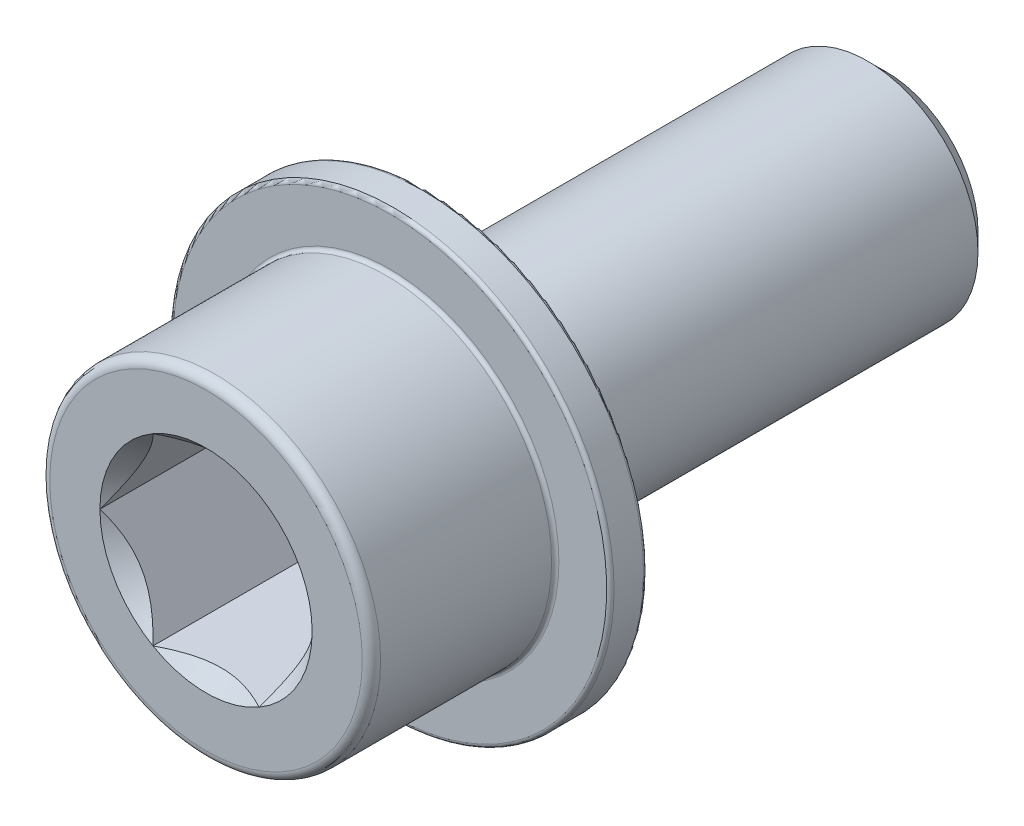
ISO-10303-21;
HEADER;
FILE_DESCRIPTION(('STEP AP214'),'2;1');
FILE_NAME('part.step','',(''),(''),'','','');
FILE_SCHEMA(('AUTOMOTIVE_DESIGN { 1 0 10303 214 1 1 1 1 }'));
ENDSEC;
DATA;
#1=APPLICATION_CONTEXT('core data for automotive mechanical design processes');
#2=APPLICATION_PROTOCOL_DEFINITION('international standard','automotive_design',2000,#1);
#3=PRODUCT_CONTEXT('',#1,'mechanical');
#4=PRODUCT('Part','Part','',(#3));
#5=PRODUCT_RELATED_PRODUCT_CATEGORY('part','',(#4));
#6=PRODUCT_DEFINITION_FORMATION('','',#4);
#7=PRODUCT_DEFINITION_CONTEXT('part definition',#1,'design');
#8=PRODUCT_DEFINITION('design','',#6,#7);
#9=PRODUCT_DEFINITION_SHAPE('','',#8);
#10=(LENGTH_UNIT() NAMED_UNIT(*) SI_UNIT(.MILLI.,.METRE.));
#11=(NAMED_UNIT(*) PLANE_ANGLE_UNIT() SI_UNIT($,.RADIAN.));
#12=(NAMED_UNIT(*) SI_UNIT($,.STERADIAN.) SOLID_ANGLE_UNIT());
#13=UNCERTAINTY_MEASURE_WITH_UNIT(LENGTH_MEASURE(1.E-05),#10,'distance_accuracy_value','');
#14=(GEOMETRIC_REPRESENTATION_CONTEXT(3) GLOBAL_UNCERTAINTY_ASSIGNED_CONTEXT((#13)) GLOBAL_UNIT_ASSIGNED_CONTEXT((#10,
#11,#12)) REPRESENTATION_CONTEXT('',''));
#15=CARTESIAN_POINT('',(0.,0.,0.));
#16=DIRECTION('',(0.,0.,1.));
#17=DIRECTION('',(1.,0.,0.));
#18=AXIS2_PLACEMENT_3D('',#15,#16,#17);
#19=CARTESIAN_POINT('',(0.,0.,37.));
#20=DIRECTION('',(0.,0.,-1.));
#21=DIRECTION('',(-1.,0.,0.));
#22=AXIS2_PLACEMENT_3D('',#19,#20,#21);
#23=CYLINDRICAL_SURFACE('',#22,9.);
#24=CARTESIAN_POINT('',(0.,0.,27.2));
#25=DIRECTION('',(0.,0.,-1.));
#26=DIRECTION('',(-1.,0.,0.));
#27=AXIS2_PLACEMENT_3D('',#24,#25,#26);
#28=CIRCLE('',#27,9.);
#29=CARTESIAN_POINT('',(-9.,0.,27.2));
#30=VERTEX_POINT('',#29);
#31=EDGE_CURVE('E11',#30,#30,#28,.F.);
#32=ORIENTED_EDGE('',*,*,#31,.T.);
#33=EDGE_LOOP('',(#32));
#34=FACE_BOUND('',#33,.T.);
#35=CARTESIAN_POINT('',(0.,0.,36.5));
#36=DIRECTION('',(0.,0.,1.));
#37=DIRECTION('',(1.,0.,0.));
#38=AXIS2_PLACEMENT_3D('',#35,#36,#37);
#39=CIRCLE('',#38,9.);
#40=CARTESIAN_POINT('',(9.,0.,36.5));
#41=VERTEX_POINT('',#40);
#42=EDGE_CURVE('E275',#41,#41,#39,.F.);
#43=ORIENTED_EDGE('',*,*,#42,.T.);
#44=EDGE_LOOP('',(#43));
#45=FACE_BOUND('',#44,.T.);
#46=ADVANCED_FACE('F41',(#34,#45),#23,.T.);
#47=CARTESIAN_POINT('',(0.,0.,37.));
#48=DIRECTION('',(0.,0.,1.));
#49=DIRECTION('',(1.,0.,0.));
#50=AXIS2_PLACEMENT_3D('',#47,#48,#49);
#51=PLANE('',#50);
#52=CARTESIAN_POINT('',(0.,0.,37.));
#53=DIRECTION('',(0.,0.,1.));
#54=DIRECTION('',(1.,0.,0.));
#55=AXIS2_PLACEMENT_3D('',#52,#53,#54);
#56=CIRCLE('',#55,8.5);
#57=CARTESIAN_POINT('',(8.5,0.,37.));
#58=VERTEX_POINT('',#57);
#59=EDGE_CURVE('E117',#58,#58,#56,.T.);
#60=ORIENTED_EDGE('',*,*,#59,.T.);
#61=EDGE_LOOP('',(#60));
#62=FACE_BOUND('',#61,.T.);
#63=CARTESIAN_POINT('',(0.,0.,37.));
#64=DIRECTION('',(0.,0.,1.));
#65=DIRECTION('',(1.,0.,0.));
#66=AXIS2_PLACEMENT_3D('',#63,#64,#65);
#67=CIRCLE('',#66,5.77350269189626);
#68=CARTESIAN_POINT('',(5.77350269189626,0.,37.));
#69=VERTEX_POINT('',#68);
#70=CARTESIAN_POINT('',(2.88675134594813,5.,37.));
#71=VERTEX_POINT('',#70);
#72=EDGE_CURVE('E96',#69,#71,#67,.T.);
#73=ORIENTED_EDGE('',*,*,#72,.F.);
#74=CARTESIAN_POINT('',(2.88675134594813,-5.,37.));
#75=VERTEX_POINT('',#74);
#76=EDGE_CURVE('E56',#75,#69,#67,.T.);
#77=ORIENTED_EDGE('',*,*,#76,.F.);
#78=CARTESIAN_POINT('',(-2.88675134594813,-5.,37.));
#79=VERTEX_POINT('',#78);
#80=EDGE_CURVE('E360',#79,#75,#67,.T.);
#81=ORIENTED_EDGE('',*,*,#80,.F.);
#82=CARTESIAN_POINT('',(-5.77350269189626,0.,37.));
#83=VERTEX_POINT('',#82);
#84=EDGE_CURVE('E63',#83,#79,#67,.T.);
#85=ORIENTED_EDGE('',*,*,#84,.F.);
#86=CARTESIAN_POINT('',(-2.88675134594813,5.,37.));
#87=VERTEX_POINT('',#86);
#88=EDGE_CURVE('E141',#87,#83,#67,.T.);
#89=ORIENTED_EDGE('',*,*,#88,.F.);
#90=EDGE_CURVE('E106',#71,#87,#67,.T.);
#91=ORIENTED_EDGE('',*,*,#90,.F.);
#92=EDGE_LOOP('',(#73,#77,#81,#85,#89,#91));
#93=FACE_BOUND('',#92,.T.);
#94=ADVANCED_FACE('F140',(#62,#93),#51,.T.);
#95=CARTESIAN_POINT('',(0.,0.,37.));
#96=DIRECTION('',(0.,0.,1.));
#97=DIRECTION('',(1.,0.,0.));
#98=AXIS2_PLACEMENT_3D('',#95,#96,#97);
#99=CONICAL_SURFACE('',#98,5.77350269189626,0.750491578357562);
#100=ORIENTED_EDGE('',*,*,#90,.T.);
#101=CARTESIAN_POINT('',(-5.80758708365003,5.,39.0266924983365));
#102=CARTESIAN_POINT('',(-5.66865629007263,5.,38.9138127130235));
#103=CARTESIAN_POINT('',(-5.52889793648,5.,38.8019351056511));
#104=CARTESIAN_POINT('',(-5.24739132077965,5.,38.580638613981));
#105=CARTESIAN_POINT('',(-5.1056425509307,5.,38.4712203762683));
#106=CARTESIAN_POINT('',(-4.81871487435336,5.,38.254466766855));
#107=CARTESIAN_POINT('',(-4.67351732727593,5.,38.1471559887066));
#108=CARTESIAN_POINT('',(-4.38046871079382,5.,37.9362345434395));
#109=CARTESIAN_POINT('',(-4.23261785089912,5.,37.8326235860917));
#110=CARTESIAN_POINT('',(-3.92683315677779,5.,37.6252088953714));
#111=CARTESIAN_POINT('',(-3.76875109674688,5.,37.5216226384209));
#112=CARTESIAN_POINT('',(-3.44860006517848,5.,37.3206998859556));
#113=CARTESIAN_POINT('',(-3.2865303934545,5.,37.2233644990234));
#114=CARTESIAN_POINT('',(-2.95838317622288,5.,37.0369808971182));
#115=CARTESIAN_POINT('',(-2.79232094070495,5.,36.9479059154129));
#116=CARTESIAN_POINT('',(-2.45517018440643,5.,36.7799114874638));
#117=CARTESIAN_POINT('',(-2.28408423421819,5.,36.7009869548332));
#118=CARTESIAN_POINT('',(-1.98420138431349,5.,36.5759442429651));
#119=CARTESIAN_POINT('',(-1.85668369197688,5.,36.5267669252763));
#120=CARTESIAN_POINT('',(-1.59878046410578,5.,36.4364409854512));
#121=CARTESIAN_POINT('',(-1.46839441463696,5.,36.3952938153605));
#122=CARTESIAN_POINT('',(-1.20618189730262,5.,36.322673503087));
#123=CARTESIAN_POINT('',(-1.0743786710018,5.,36.2911172981687));
#124=CARTESIAN_POINT('',(-0.808715932019676,5.,36.2383996188333));
#125=CARTESIAN_POINT('',(-0.674856892852049,5.,36.2172357867084));
#126=CARTESIAN_POINT('',(-0.401899799658879,5.,36.1857896131402));
#127=CARTESIAN_POINT('',(-0.262762574295458,5.,36.175841515954));
#128=CARTESIAN_POINT('',(0.0158398234206421,5.,36.1684669793754));
#129=CARTESIAN_POINT('',(0.15530497868332,5.,36.1710399013017));
#130=CARTESIAN_POINT('',(0.433665504023498,5.,36.188583322808));
#131=CARTESIAN_POINT('',(0.572559623573486,5.,36.2035734299528));
#132=CARTESIAN_POINT('',(0.848582612400783,5.,36.245215303668));
#133=CARTESIAN_POINT('',(0.985711136904931,5.,36.2718693133705));
#134=CARTESIAN_POINT('',(1.31134176502766,5.,36.3483053015187));
#135=CARTESIAN_POINT('',(1.49867542442878,5.,36.4030664771283));
#136=CARTESIAN_POINT('',(1.86761079985639,5.,36.5292693755651));
#137=CARTESIAN_POINT('',(2.04920912710151,5.,36.6007207581378));
#138=CARTESIAN_POINT('',(2.4088509799602,5.,36.7576881875208));
#139=CARTESIAN_POINT('',(2.58682221540366,5.,36.8433680887937));
#140=CARTESIAN_POINT('',(2.84964460165159,5.,36.9796538633223));
#141=CARTESIAN_POINT('',(2.9365527090353,5.,37.0263706463591));
#142=CARTESIAN_POINT('',(3.1090948045498,5.,37.1220981743121));
#143=CARTESIAN_POINT('',(3.19472883043855,5.,37.1711088510684));
#144=CARTESIAN_POINT('',(3.44856639783359,5.,37.3204058779647));
#145=CARTESIAN_POINT('',(3.61502982140971,5.,37.4236543117435));
#146=CARTESIAN_POINT('',(3.94395944593554,5.,37.6363575000928));
#147=CARTESIAN_POINT('',(4.10642475243023,5.,37.7458136256645));
#148=CARTESIAN_POINT('',(4.42805284665852,5.,37.9697135514027));
#149=CARTESIAN_POINT('',(4.58721302784413,5.,38.0841610827746));
#150=CARTESIAN_POINT('',(4.90263186914906,5.,38.3169973733478));
#151=CARTESIAN_POINT('',(5.05889030478379,5.,38.4353864355111));
#152=CARTESIAN_POINT('',(5.36952826406589,5.,38.6758169768031));
#153=CARTESIAN_POINT('',(5.52389824343529,5.,38.7978707578687));
#154=CARTESIAN_POINT('',(5.83051209253211,5.,39.0446237625617));
#155=CARTESIAN_POINT('',(5.98275588901246,5.,39.1693230769568));
#156=CARTESIAN_POINT('',(6.4367961421282,5.,39.5467110731217));
#157=CARTESIAN_POINT('',(6.73587657171413,5.,39.802670302999));
#158=CARTESIAN_POINT('',(7.16593516235032,5.,40.1785473745907));
#159=CARTESIAN_POINT('',(7.29907335598806,5.,40.2960191652605));
#160=CARTESIAN_POINT('',(7.56436261704639,5.,40.532055910625));
#161=CARTESIAN_POINT('',(7.6965137515873,5.,40.6506207897416));
#162=CARTESIAN_POINT('',(8.0917131015929,5.,41.0077812186704));
#163=CARTESIAN_POINT('',(8.35346780136019,5.,41.2478079212028));
#164=CARTESIAN_POINT('',(8.87188598984394,5.,41.7286102779452));
#165=CARTESIAN_POINT('',(9.1285741194123,5.,41.9693594407662));
#166=CARTESIAN_POINT('',(9.63970731590792,5.,42.4531282757413));
#167=CARTESIAN_POINT('',(9.89415281567278,5.,42.6961474902501));
#168=CARTESIAN_POINT('',(10.1477473123788,5.,42.940042639505));
#169=B_SPLINE_CURVE_WITH_KNOTS('',3,(#101,#102,#103,#104,#105,#106,#107,#108,#109,#110,#111,
#112,#113,#114,#115,#116,#117,#118,#119,#120,#121,#122,#123,#124,#125,#126,#127,#128,#129,#130,
#131,#132,#133,#134,#135,#136,#137,#138,#139,#140,#141,#142,#143,#144,#145,#146,#147,#148,#149,
#150,#151,#152,#153,#154,#155,#156,#157,#158,#159,#160,#161,#162,#163,#164,#165,#166,#167,#168),
.UNSPECIFIED.,.F.,.F.,(4,2,2,2,2,2,2,2,2,2,2,2,2,2,2,2,2,2,2,2,2,2,2,2,2,2,2,2,2,2,2,2,2,4),(0.,
0.537032521937178,1.07420461985825,1.61580322328329,2.1573592477286,2.72423532494798,
3.29121166074129,3.85628141753499,4.42106690554731,4.83086054028644,5.24072820714058,
5.64693782157675,6.05305523699244,6.47097964283559,6.8888827311043,7.30744697700931,
7.72609175409067,8.31058154073312,8.89541045280198,9.48751213288203,9.78349127781271,
10.0794616337318,10.6669174856502,11.2545035893655,11.8425367209901,12.4306151560463,
13.0209566103805,13.611318352079,14.7921366637501,15.3247964486711,15.8574196766327,
16.922823639663,17.9785742840354,19.0341164939846),.UNSPECIFIED.);
#170=EDGE_CURVE('E111',#71,#87,#169,.F.);
#171=ORIENTED_EDGE('',*,*,#170,.F.);
#172=EDGE_LOOP('',(#100,#171));
#173=FACE_BOUND('',#172,.T.);
#174=ADVANCED_FACE('F112',(#173),#99,.F.);
#175=ORIENTED_EDGE('',*,*,#88,.T.);
#176=CARTESIAN_POINT('',(-2.88663587589429,5.0002,37.0001238301874));
#177=CARTESIAN_POINT('',(-2.93339586390976,4.91920932499589,36.9499840138978));
#178=CARTESIAN_POINT('',(-2.98053379033613,4.83756404146197,36.9012512877692));
#179=CARTESIAN_POINT('',(-3.07564128643495,4.67283302603816,36.8070245965211));
#180=CARTESIAN_POINT('',(-3.12361127703016,4.58974656508865,36.7615323338394));
#181=CARTESIAN_POINT('',(-3.26935709555591,4.33730740241135,36.6301366115751));
#182=CARTESIAN_POINT('',(-3.36844052634802,4.16568986609118,36.5498923825744));
#183=CARTESIAN_POINT('',(-3.56866454479605,3.81889169324358,36.410108426193));
#184=CARTESIAN_POINT('',(-3.66975381389791,3.64379994305916,36.350282912226));
#185=CARTESIAN_POINT('',(-3.82334924134509,3.37776485891039,36.2785251413902));
#186=CARTESIAN_POINT('',(-3.87482121177902,3.28861279095313,36.2576148137686));
#187=CARTESIAN_POINT('',(-3.97831234653932,3.10936088741533,36.2222440250122));
#188=CARTESIAN_POINT('',(-4.03033142099721,3.01926120749156,36.2077825210077));
#189=CARTESIAN_POINT('',(-4.15393426093205,2.80517480876461,36.1816631188413));
#190=CARTESIAN_POINT('',(-4.22568233877823,2.68090349258962,36.1729888137491));
#191=CARTESIAN_POINT('',(-4.36928865720894,2.43217005277971,36.1689650395851));
#192=CARTESIAN_POINT('',(-4.44114692294564,2.30770788557996,36.1736192891434));
#193=CARTESIAN_POINT('',(-4.58441508762602,2.0595601452464,36.1960039502723));
#194=CARTESIAN_POINT('',(-4.65582448994055,1.9358754322995,36.213746910055));
#195=CARTESIAN_POINT('',(-4.79760141304727,1.69031059813788,36.2613846291909));
#196=CARTESIAN_POINT('',(-4.86796900839078,1.56843034779648,36.2912785146294));
#197=CARTESIAN_POINT('',(-5.01066397081816,1.32127542288813,36.3635432129595));
#198=CARTESIAN_POINT('',(-5.08292353946059,1.19611817866643,36.4064435225763));
#199=CARTESIAN_POINT('',(-5.22576763086089,0.948704954800094,36.5023651109165));
#200=CARTESIAN_POINT('',(-5.29635120779529,0.826450613369762,36.5553919586377));
#201=CARTESIAN_POINT('',(-5.43573312300757,0.585034054565836,36.6698219593191));
#202=CARTESIAN_POINT('',(-5.50453243256156,0.46587015489267,36.7312204361734));
#203=CARTESIAN_POINT('',(-5.64035275855527,0.23062244957099,36.860874116103));
#204=CARTESIAN_POINT('',(-5.7073767182989,0.114533545970578,36.9291169384668));
#205=CARTESIAN_POINT('',(-5.77361816195009,-0.000200000000002794,37.0001238301874));
#206=B_SPLINE_CURVE_WITH_KNOTS('',3,(#176,#177,#178,#179,#180,#181,#182,#183,#184,#185,#186,
#187,#188,#189,#190,#191,#192,#193,#194,#195,#196,#197,#198,#199,#200,#201,#202,#203,#204,#205),
.UNSPECIFIED.,.F.,.F.,(4,2,2,2,2,2,2,2,2,2,2,2,2,2,4),(0.,0.318321466427512,0.636808953996699,
1.27738825230496,1.90859395776303,2.22355579998591,2.53846668975006,2.96911088131721,
3.39987523313684,3.83105309849362,4.26219995831788,4.71401852227362,5.1660862790372,
5.61790255280598,6.06891579392637),.UNSPECIFIED.);
#207=EDGE_CURVE('E105',#87,#83,#206,.T.);
#208=ORIENTED_EDGE('',*,*,#207,.F.);
#209=EDGE_LOOP('',(#175,#208));
#210=FACE_BOUND('',#209,.T.);
#211=ADVANCED_FACE('F371',(#210),#99,.F.);
#212=ORIENTED_EDGE('',*,*,#84,.T.);
#213=CARTESIAN_POINT('',(-5.77361816195009,0.000199999999998372,37.0001238301874));
#214=CARTESIAN_POINT('',(-5.72685817393462,-0.0807906750041104,36.9499840138978));
#215=CARTESIAN_POINT('',(-5.67972024750825,-0.162435958538028,36.9012512877692));
#216=CARTESIAN_POINT('',(-5.58461275140944,-0.327166973961837,36.8070245965211));
#217=CARTESIAN_POINT('',(-5.53664276081422,-0.410253434911349,36.7615323338394));
#218=CARTESIAN_POINT('',(-5.39089694228848,-0.662692597588651,36.6301366115751));
#219=CARTESIAN_POINT('',(-5.29181351149637,-0.834310133908815,36.5498923825744));
#220=CARTESIAN_POINT('',(-5.09158949304834,-1.18110830675642,36.410108426193));
#221=CARTESIAN_POINT('',(-4.99050022394648,-1.35620005694084,36.350282912226));
#222=CARTESIAN_POINT('',(-4.8369047964993,-1.62223514108961,36.2785251413902));
#223=CARTESIAN_POINT('',(-4.78543282606537,-1.71138720904686,36.2576148137686));
#224=CARTESIAN_POINT('',(-4.68194169130506,-1.89063911258467,36.2222440250123));
#225=CARTESIAN_POINT('',(-4.62992261684718,-1.98073879250843,36.2077825210077));
#226=CARTESIAN_POINT('',(-4.50631977691234,-2.19482519123538,36.1816631188413));
#227=CARTESIAN_POINT('',(-4.43457169906615,-2.31909650741038,36.1729888137491));
#228=CARTESIAN_POINT('',(-4.29096538063544,-2.56782994722028,36.1689650395851));
#229=CARTESIAN_POINT('',(-4.21910711489874,-2.69229211442003,36.1736192891434));
#230=CARTESIAN_POINT('',(-4.07583895021836,-2.9404398547536,36.1960039502723));
#231=CARTESIAN_POINT('',(-4.00442954790383,-3.06412456770049,36.213746910055));
#232=CARTESIAN_POINT('',(-3.86265262479711,-3.30968940186212,36.2613846291909));
#233=CARTESIAN_POINT('',(-3.7922850294536,-3.43156965220352,36.2912785146294));
#234=CARTESIAN_POINT('',(-3.64959006702623,-3.67872457711187,36.3635432129595));
#235=CARTESIAN_POINT('',(-3.57733049838379,-3.80388182133357,36.4064435225763));
#236=CARTESIAN_POINT('',(-3.43448640698349,-4.0512950451999,36.5023651109165));
#237=CARTESIAN_POINT('',(-3.36390283004909,-4.17354938663023,36.5553919586377));
#238=CARTESIAN_POINT('',(-3.22452091483681,-4.41496594543416,36.6698219593191));
#239=CARTESIAN_POINT('',(-3.15572160528282,-4.53412984510733,36.7312204361734));
#240=CARTESIAN_POINT('',(-3.01990127928911,-4.76937755042901,36.860874116103));
#241=CARTESIAN_POINT('',(-2.95287731954548,-4.88546645402942,36.9291169384668));
#242=CARTESIAN_POINT('',(-2.88663587589429,-5.0002,37.0001238301874));
#243=B_SPLINE_CURVE_WITH_KNOTS('',3,(#213,#214,#215,#216,#217,#218,#219,#220,#221,#222,#223,
#224,#225,#226,#227,#228,#229,#230,#231,#232,#233,#234,#235,#236,#237,#238,#239,#240,#241,#242),
.UNSPECIFIED.,.F.,.F.,(4,2,2,2,2,2,2,2,2,2,2,2,2,2,4),(0.,0.318321466427509,0.636808953996697,
1.27738825230495,1.90859395776302,2.2235557999859,2.53846668975005,2.9691108813172,
3.39987523313683,3.83105309849361,4.26219995831788,4.71401852227361,5.1660862790372,
5.61790255280598,6.06891579392637),.UNSPECIFIED.);
#244=EDGE_CURVE('E154',#83,#79,#243,.T.);
#245=ORIENTED_EDGE('',*,*,#244,.F.);
#246=EDGE_LOOP('',(#212,#245));
#247=FACE_BOUND('',#246,.T.);
#248=ADVANCED_FACE('F373',(#247),#99,.F.);
#249=ORIENTED_EDGE('',*,*,#80,.T.);
#250=CARTESIAN_POINT('',(-5.80758708365002,-5.,39.0266924983365));
#251=CARTESIAN_POINT('',(-5.66865629007262,-5.,38.9138127130235));
#252=CARTESIAN_POINT('',(-5.52889793648,-5.,38.8019351056511));
#253=CARTESIAN_POINT('',(-5.24739132077965,-5.,38.580638613981));
#254=CARTESIAN_POINT('',(-5.10564255093069,-5.,38.4712203762683));
#255=CARTESIAN_POINT('',(-4.81871487435336,-5.,38.254466766855));
#256=CARTESIAN_POINT('',(-4.67351732727593,-5.,38.1471559887066));
#257=CARTESIAN_POINT('',(-4.38046871079381,-5.,37.9362345434395));
#258=CARTESIAN_POINT('',(-4.23261785089912,-5.,37.8326235860917));
#259=CARTESIAN_POINT('',(-3.92683315677779,-5.,37.6252088953714));
#260=CARTESIAN_POINT('',(-3.76875109674688,-5.,37.5216226384209));
#261=CARTESIAN_POINT('',(-3.44860006517848,-5.,37.3206998859556));
#262=CARTESIAN_POINT('',(-3.2865303934545,-5.,37.2233644990234));
#263=CARTESIAN_POINT('',(-2.95838317622287,-5.,37.0369808971182));
#264=CARTESIAN_POINT('',(-2.79232094070495,-5.,36.9479059154129));
#265=CARTESIAN_POINT('',(-2.45517018440643,-5.,36.7799114874638));
#266=CARTESIAN_POINT('',(-2.28408423421819,-5.,36.7009869548332));
#267=CARTESIAN_POINT('',(-1.98420138431349,-5.,36.5759442429651));
#268=CARTESIAN_POINT('',(-1.85668369197688,-5.,36.5267669252763));
#269=CARTESIAN_POINT('',(-1.59878046410578,-5.,36.4364409854512));
#270=CARTESIAN_POINT('',(-1.46839441463696,-5.,36.3952938153605));
#271=CARTESIAN_POINT('',(-1.20618189730262,-5.,36.322673503087));
#272=CARTESIAN_POINT('',(-1.0743786710018,-5.,36.2911172981687));
#273=CARTESIAN_POINT('',(-0.808715932019671,-5.,36.2383996188333));
#274=CARTESIAN_POINT('',(-0.674856892852044,-5.,36.2172357867084));
#275=CARTESIAN_POINT('',(-0.401899799658875,-5.,36.1857896131402));
#276=CARTESIAN_POINT('',(-0.262762574295453,-5.,36.175841515954));
#277=CARTESIAN_POINT('',(0.0158398234206466,-5.,36.1684669793754));
#278=CARTESIAN_POINT('',(0.155304978683324,-5.,36.1710399013017));
#279=CARTESIAN_POINT('',(0.433665504023504,-5.,36.188583322808));
#280=CARTESIAN_POINT('',(0.572559623573492,-5.,36.2035734299528));
#281=CARTESIAN_POINT('',(0.848582612400789,-5.,36.245215303668));
#282=CARTESIAN_POINT('',(0.985711136904937,-5.,36.2718693133705));
#283=CARTESIAN_POINT('',(1.31134176502767,-5.,36.3483053015187));
#284=CARTESIAN_POINT('',(1.49867542442879,-5.,36.4030664771283));
#285=CARTESIAN_POINT('',(1.8676107998564,-5.,36.5292693755651));
#286=CARTESIAN_POINT('',(2.04920912710151,-5.,36.6007207581378));
#287=CARTESIAN_POINT('',(2.40885097996021,-5.,36.7576881875208));
#288=CARTESIAN_POINT('',(2.58682221540368,-5.,36.8433680887937));
#289=CARTESIAN_POINT('',(2.8496446016516,-5.,36.9796538633223));
#290=CARTESIAN_POINT('',(2.93655270903531,-5.,37.0263706463591));
#291=CARTESIAN_POINT('',(3.10909480454981,-5.,37.1220981743121));
#292=CARTESIAN_POINT('',(3.19472883043856,-5.,37.1711088510684));
#293=CARTESIAN_POINT('',(3.4485663978336,-5.,37.3204058779647));
#294=CARTESIAN_POINT('',(3.61502982140972,-5.,37.4236543117435));
#295=CARTESIAN_POINT('',(3.94395944593555,-5.,37.6363575000928));
#296=CARTESIAN_POINT('',(4.10642475243024,-5.,37.7458136256645));
#297=CARTESIAN_POINT('',(4.42805284665853,-5.,37.9697135514027));
#298=CARTESIAN_POINT('',(4.58721302784414,-5.,38.0841610827746));
#299=CARTESIAN_POINT('',(4.90263186914907,-5.,38.3169973733478));
#300=CARTESIAN_POINT('',(5.05889030478381,-5.,38.4353864355111));
#301=CARTESIAN_POINT('',(5.3695282640659,-5.,38.6758169768031));
#302=CARTESIAN_POINT('',(5.5238982434353,-5.,38.7978707578687));
#303=CARTESIAN_POINT('',(5.83051209253212,-5.,39.0446237625617));
#304=CARTESIAN_POINT('',(5.98275588901247,-5.,39.1693230769569));
#305=CARTESIAN_POINT('',(6.43679614212822,-5.,39.5467110731217));
#306=CARTESIAN_POINT('',(6.73587657171415,-5.,39.802670302999));
#307=CARTESIAN_POINT('',(7.16593516235035,-5.,40.1785473745907));
#308=CARTESIAN_POINT('',(7.29907335598809,-5.,40.2960191652605));
#309=CARTESIAN_POINT('',(7.56436261704642,-5.,40.5320559106251));
#310=CARTESIAN_POINT('',(7.69651375158733,-5.,40.6506207897416));
#311=CARTESIAN_POINT('',(8.09171310159293,-5.,41.0077812186705));
#312=CARTESIAN_POINT('',(8.35346780136022,-5.,41.2478079212029));
#313=CARTESIAN_POINT('',(8.87188598984398,-5.,41.7286102779452));
#314=CARTESIAN_POINT('',(9.12857411941233,-5.,41.9693594407662));
#315=CARTESIAN_POINT('',(9.63970731590796,-5.,42.4531282757414));
#316=CARTESIAN_POINT('',(9.89415281567281,-5.,42.6961474902502));
#317=CARTESIAN_POINT('',(10.1477473123788,-5.,42.940042639505));
#318=B_SPLINE_CURVE_WITH_KNOTS('',3,(#250,#251,#252,#253,#254,#255,#256,#257,#258,#259,#260,
#261,#262,#263,#264,#265,#266,#267,#268,#269,#270,#271,#272,#273,#274,#275,#276,#277,#278,#279,
#280,#281,#282,#283,#284,#285,#286,#287,#288,#289,#290,#291,#292,#293,#294,#295,#296,#297,#298,
#299,#300,#301,#302,#303,#304,#305,#306,#307,#308,#309,#310,#311,#312,#313,#314,#315,#316,#317),
.UNSPECIFIED.,.F.,.F.,(4,2,2,2,2,2,2,2,2,2,2,2,2,2,2,2,2,2,2,2,2,2,2,2,2,2,2,2,2,2,2,2,2,4),(0.,
0.537032521937176,1.07420461985825,1.61580322328328,2.1573592477286,2.72423532494797,
3.29121166074128,3.85628141753499,4.42106690554731,4.83086054028644,5.24072820714058,
5.64693782157675,6.05305523699244,6.47097964283559,6.8888827311043,7.30744697700931,
7.72609175409067,8.31058154073312,8.89541045280198,9.48751213288204,9.78349127781271,
10.0794616337318,10.6669174856502,11.2545035893655,11.8425367209901,12.4306151560463,
13.0209566103805,13.611318352079,14.7921366637502,15.3247964486711,15.8574196766328,
16.9228236396631,17.9785742840354,19.0341164939846),.UNSPECIFIED.);
#319=EDGE_CURVE('E184',#79,#75,#318,.T.);
#320=ORIENTED_EDGE('',*,*,#319,.F.);
#321=EDGE_LOOP('',(#249,#320));
#322=FACE_BOUND('',#321,.T.);
#323=ADVANCED_FACE('F361',(#322),#99,.F.);
#324=ORIENTED_EDGE('',*,*,#76,.T.);
#325=CARTESIAN_POINT('',(2.88663587589429,-5.0002,37.0001238301874));
#326=CARTESIAN_POINT('',(2.93339586390976,-4.91920932499589,36.9499840138978));
#327=CARTESIAN_POINT('',(2.98053379033614,-4.83756404146197,36.9012512877692));
#328=CARTESIAN_POINT('',(3.07564128643495,-4.67283302603816,36.8070245965211));
#329=CARTESIAN_POINT('',(3.12361127703017,-4.58974656508865,36.7615323338394));
#330=CARTESIAN_POINT('',(3.26935709555591,-4.33730740241135,36.6301366115751));
#331=CARTESIAN_POINT('',(3.36844052634802,-4.16568986609118,36.5498923825744));
#332=CARTESIAN_POINT('',(3.56866454479605,-3.81889169324358,36.410108426193));
#333=CARTESIAN_POINT('',(3.66975381389791,-3.64379994305916,36.350282912226));
#334=CARTESIAN_POINT('',(3.82334924134509,-3.37776485891039,36.2785251413902));
#335=CARTESIAN_POINT('',(3.87482121177902,-3.28861279095314,36.2576148137686));
#336=CARTESIAN_POINT('',(3.97831234653933,-3.10936088741533,36.2222440250123));
#337=CARTESIAN_POINT('',(4.03033142099721,-3.01926120749156,36.2077825210077));
#338=CARTESIAN_POINT('',(4.15393426093205,-2.80517480876461,36.1816631188413));
#339=CARTESIAN_POINT('',(4.22568233877824,-2.68090349258962,36.1729888137491));
#340=CARTESIAN_POINT('',(4.36928865720895,-2.43217005277971,36.1689650395851));
#341=CARTESIAN_POINT('',(4.44114692294565,-2.30770788557996,36.1736192891434));
#342=CARTESIAN_POINT('',(4.58441508762603,-2.05956014524639,36.1960039502723));
#343=CARTESIAN_POINT('',(4.65582448994056,-1.9358754322995,36.2137469100551));
#344=CARTESIAN_POINT('',(4.79760141304728,-1.69031059813787,36.2613846291909));
#345=CARTESIAN_POINT('',(4.86796900839079,-1.56843034779647,36.2912785146294));
#346=CARTESIAN_POINT('',(5.01066397081816,-1.32127542288812,36.3635432129595));
#347=CARTESIAN_POINT('',(5.08292353946059,-1.19611817866642,36.4064435225763));
#348=CARTESIAN_POINT('',(5.22576763086089,-0.948704954800093,36.5023651109165));
#349=CARTESIAN_POINT('',(5.29635120779529,-0.826450613369763,36.5553919586377));
#350=CARTESIAN_POINT('',(5.43573312300757,-0.585034054565837,36.6698219593191));
#351=CARTESIAN_POINT('',(5.50453243256156,-0.46587015489267,36.7312204361734));
#352=CARTESIAN_POINT('',(5.64035275855528,-0.230622449570991,36.860874116103));
#353=CARTESIAN_POINT('',(5.7073767182989,-0.114533545970581,36.9291169384668));
#354=CARTESIAN_POINT('',(5.7736181619501,0.000199999999999415,37.0001238301874));
#355=B_SPLINE_CURVE_WITH_KNOTS('',3,(#325,#326,#327,#328,#329,#330,#331,#332,#333,#334,#335,
#336,#337,#338,#339,#340,#341,#342,#343,#344,#345,#346,#347,#348,#349,#350,#351,#352,#353,#354),
.UNSPECIFIED.,.F.,.F.,(4,2,2,2,2,2,2,2,2,2,2,2,2,2,4),(0.,0.318321466427517,0.636808953996705,
1.27738825230496,1.90859395776304,2.22355579998591,2.53846668975007,2.96911088131722,
3.39987523313685,3.83105309849363,4.26219995831789,4.71401852227362,5.16608627903721,
5.61790255280599,6.06891579392637),.UNSPECIFIED.);
#356=EDGE_CURVE('E129',#75,#69,#355,.T.);
#357=ORIENTED_EDGE('',*,*,#356,.F.);
#358=EDGE_LOOP('',(#324,#357));
#359=FACE_BOUND('',#358,.T.);
#360=ADVANCED_FACE('F169',(#359),#99,.F.);
#361=ORIENTED_EDGE('',*,*,#72,.T.);
#362=CARTESIAN_POINT('',(5.7736181619501,-0.000200000000000382,37.0001238301874));
#363=CARTESIAN_POINT('',(5.72685817393462,0.0807906750041101,36.9499840138978));
#364=CARTESIAN_POINT('',(5.67972024750825,0.162435958538028,36.9012512877692));
#365=CARTESIAN_POINT('',(5.58461275140944,0.327166973961838,36.8070245965211));
#366=CARTESIAN_POINT('',(5.53664276081422,0.41025343491135,36.7615323338394));
#367=CARTESIAN_POINT('',(5.39089694228848,0.662692597588653,36.6301366115751));
#368=CARTESIAN_POINT('',(5.29181351149637,0.834310133908818,36.5498923825744));
#369=CARTESIAN_POINT('',(5.09158949304834,1.18110830675642,36.410108426193));
#370=CARTESIAN_POINT('',(4.99050022394648,1.35620005694084,36.350282912226));
#371=CARTESIAN_POINT('',(4.8369047964993,1.62223514108961,36.2785251413902));
#372=CARTESIAN_POINT('',(4.78543282606537,1.71138720904686,36.2576148137686));
#373=CARTESIAN_POINT('',(4.68194169130506,1.89063911258467,36.2222440250123));
#374=CARTESIAN_POINT('',(4.62992261684718,1.98073879250844,36.2077825210077));
#375=CARTESIAN_POINT('',(4.50631977691234,2.19482519123539,36.1816631188413));
#376=CARTESIAN_POINT('',(4.43457169906615,2.31909650741038,36.1729888137491));
#377=CARTESIAN_POINT('',(4.29096538063544,2.56782994722029,36.1689650395851));
#378=CARTESIAN_POINT('',(4.21910711489874,2.69229211442004,36.1736192891434));
#379=CARTESIAN_POINT('',(4.07583895021836,2.94043985475361,36.1960039502723));
#380=CARTESIAN_POINT('',(4.00442954790383,3.0641245677005,36.2137469100551));
#381=CARTESIAN_POINT('',(3.86265262479711,3.30968940186213,36.2613846291909));
#382=CARTESIAN_POINT('',(3.7922850294536,3.43156965220353,36.2912785146294));
#383=CARTESIAN_POINT('',(3.64959006702622,3.67872457711188,36.3635432129595));
#384=CARTESIAN_POINT('',(3.57733049838379,3.80388182133358,36.4064435225763));
#385=CARTESIAN_POINT('',(3.43448640698349,4.05129504519991,36.5023651109165));
#386=CARTESIAN_POINT('',(3.36390283004909,4.17354938663024,36.5553919586377));
#387=CARTESIAN_POINT('',(3.22452091483681,4.41496594543417,36.6698219593191));
#388=CARTESIAN_POINT('',(3.15572160528282,4.53412984510733,36.7312204361734));
#389=CARTESIAN_POINT('',(3.01990127928911,4.76937755042901,36.860874116103));
#390=CARTESIAN_POINT('',(2.95287731954549,4.88546645402942,36.9291169384668));
#391=CARTESIAN_POINT('',(2.88663587589429,5.0002,37.0001238301874));
#392=B_SPLINE_CURVE_WITH_KNOTS('',3,(#362,#363,#364,#365,#366,#367,#368,#369,#370,#371,#372,
#373,#374,#375,#376,#377,#378,#379,#380,#381,#382,#383,#384,#385,#386,#387,#388,#389,#390,#391),
.UNSPECIFIED.,.F.,.F.,(4,2,2,2,2,2,2,2,2,2,2,2,2,2,4),(0.,0.318321466427513,0.636808953996704,
1.27738825230496,1.90859395776304,2.22355579998591,2.53846668975006,2.96911088131721,
3.39987523313685,3.83105309849362,4.26219995831789,4.71401852227363,5.16608627903721,
5.61790255280599,6.06891579392638),.UNSPECIFIED.);
#393=EDGE_CURVE('E100',#69,#71,#392,.T.);
#394=ORIENTED_EDGE('',*,*,#393,.F.);
#395=EDGE_LOOP('',(#361,#394));
#396=FACE_BOUND('',#395,.T.);
#397=ADVANCED_FACE('F98',(#396),#99,.F.);
#398=CARTESIAN_POINT('',(0.,0.,29.));
#399=DIRECTION('',(0.,0.,1.));
#400=DIRECTION('',(1.,0.,0.));
#401=AXIS2_PLACEMENT_3D('',#398,#399,#400);
#402=PLANE('',#401);
#403=DIRECTION('',(-0.5,0.866025403784439,0.));
#404=VECTOR('',#403,1.);
#405=CARTESIAN_POINT('',(5.77350269189626,0.,29.));
#406=LINE('',#405,#404);
#407=CARTESIAN_POINT('',(5.77350269189626,0.,29.));
#408=VERTEX_POINT('',#407);
#409=CARTESIAN_POINT('',(2.88675134594813,5.,29.));
#410=VERTEX_POINT('',#409);
#411=EDGE_CURVE('E128',#408,#410,#406,.T.);
#412=ORIENTED_EDGE('',*,*,#411,.T.);
#413=DIRECTION('',(-1.,0.,0.));
#414=VECTOR('',#413,1.);
#415=CARTESIAN_POINT('',(2.88675134594813,5.,29.));
#416=LINE('',#415,#414);
#417=CARTESIAN_POINT('',(-2.88675134594813,5.,29.));
#418=VERTEX_POINT('',#417);
#419=EDGE_CURVE('E133',#410,#418,#416,.T.);
#420=ORIENTED_EDGE('',*,*,#419,.T.);
#421=DIRECTION('',(-0.5,-0.866025403784439,0.));
#422=VECTOR('',#421,1.);
#423=CARTESIAN_POINT('',(-2.88675134594813,5.,29.));
#424=LINE('',#423,#422);
#425=CARTESIAN_POINT('',(-5.77350269189626,0.,29.));
#426=VERTEX_POINT('',#425);
#427=EDGE_CURVE('E347',#418,#426,#424,.T.);
#428=ORIENTED_EDGE('',*,*,#427,.T.);
#429=DIRECTION('',(0.5,-0.866025403784439,0.));
#430=VECTOR('',#429,1.);
#431=CARTESIAN_POINT('',(-5.77350269189626,0.,29.));
#432=LINE('',#431,#430);
#433=CARTESIAN_POINT('',(-2.88675134594813,-5.,29.));
#434=VERTEX_POINT('',#433);
#435=EDGE_CURVE('E343',#426,#434,#432,.T.);
#436=ORIENTED_EDGE('',*,*,#435,.T.);
#437=DIRECTION('',(1.,0.,0.));
#438=VECTOR('',#437,1.);
#439=CARTESIAN_POINT('',(-2.88675134594813,-5.,29.));
#440=LINE('',#439,#438);
#441=CARTESIAN_POINT('',(2.88675134594813,-5.,29.));
#442=VERTEX_POINT('',#441);
#443=EDGE_CURVE('E339',#434,#442,#440,.T.);
#444=ORIENTED_EDGE('',*,*,#443,.T.);
#445=DIRECTION('',(0.5,0.866025403784439,0.));
#446=VECTOR('',#445,1.);
#447=CARTESIAN_POINT('',(2.88675134594813,-5.,29.));
#448=LINE('',#447,#446);
#449=EDGE_CURVE('E137',#442,#408,#448,.T.);
#450=ORIENTED_EDGE('',*,*,#449,.T.);
#451=EDGE_LOOP('',(#412,#420,#428,#436,#444,#450));
#452=FACE_BOUND('',#451,.T.);
#453=ADVANCED_FACE('F168',(#452),#402,.T.);
#454=CARTESIAN_POINT('',(2.88675134594813,5.,29.));
#455=DIRECTION('',(0.,1.,0.));
#456=DIRECTION('',(0.,0.,1.));
#457=AXIS2_PLACEMENT_3D('',#454,#455,#456);
#458=PLANE('',#457);
#459=DIRECTION('',(0.,0.,1.));
#460=VECTOR('',#459,1.);
#461=CARTESIAN_POINT('',(2.88675134594813,5.,29.));
#462=LINE('',#461,#460);
#463=EDGE_CURVE('E124',#410,#71,#462,.T.);
#464=ORIENTED_EDGE('',*,*,#463,.T.);
#465=ORIENTED_EDGE('',*,*,#170,.T.);
#466=DIRECTION('',(0.,0.,1.));
#467=VECTOR('',#466,1.);
#468=CARTESIAN_POINT('',(-2.88675134594813,5.,29.));
#469=LINE('',#468,#467);
#470=EDGE_CURVE('E136',#418,#87,#469,.T.);
#471=ORIENTED_EDGE('',*,*,#470,.F.);
#472=ORIENTED_EDGE('',*,*,#419,.F.);
#473=EDGE_LOOP('',(#464,#465,#471,#472));
#474=FACE_BOUND('',#473,.T.);
#475=ADVANCED_FACE('F131',(#474),#458,.F.);
#476=CARTESIAN_POINT('',(-2.88675134594813,5.,29.));
#477=DIRECTION('',(-0.866025403784439,0.5,0.));
#478=DIRECTION('',(-0.5,-0.866025403784439,0.));
#479=AXIS2_PLACEMENT_3D('',#476,#477,#478);
#480=PLANE('',#479);
#481=ORIENTED_EDGE('',*,*,#470,.T.);
#482=ORIENTED_EDGE('',*,*,#207,.T.);
#483=DIRECTION('',(0.,0.,1.));
#484=VECTOR('',#483,1.);
#485=CARTESIAN_POINT('',(-5.77350269189626,0.,29.));
#486=LINE('',#485,#484);
#487=EDGE_CURVE('E327',#426,#83,#486,.T.);
#488=ORIENTED_EDGE('',*,*,#487,.F.);
#489=ORIENTED_EDGE('',*,*,#427,.F.);
#490=EDGE_LOOP('',(#481,#482,#488,#489));
#491=FACE_BOUND('',#490,.T.);
#492=ADVANCED_FACE('F161',(#491),#480,.F.);
#493=CARTESIAN_POINT('',(-5.77350269189626,0.,29.));
#494=DIRECTION('',(-0.866025403784439,-0.5,0.));
#495=DIRECTION('',(0.5,-0.866025403784439,0.));
#496=AXIS2_PLACEMENT_3D('',#493,#494,#495);
#497=PLANE('',#496);
#498=ORIENTED_EDGE('',*,*,#487,.T.);
#499=ORIENTED_EDGE('',*,*,#244,.T.);
#500=DIRECTION('',(0.,0.,1.));
#501=VECTOR('',#500,1.);
#502=CARTESIAN_POINT('',(-2.88675134594813,-5.,29.));
#503=LINE('',#502,#501);
#504=EDGE_CURVE('E330',#434,#79,#503,.T.);
#505=ORIENTED_EDGE('',*,*,#504,.F.);
#506=ORIENTED_EDGE('',*,*,#435,.F.);
#507=EDGE_LOOP('',(#498,#499,#505,#506));
#508=FACE_BOUND('',#507,.T.);
#509=ADVANCED_FACE('F209',(#508),#497,.F.);
#510=CARTESIAN_POINT('',(-2.88675134594813,-5.,29.));
#511=DIRECTION('',(0.,-1.,0.));
#512=DIRECTION('',(0.,0.,-1.));
#513=AXIS2_PLACEMENT_3D('',#510,#511,#512);
#514=PLANE('',#513);
#515=ORIENTED_EDGE('',*,*,#504,.T.);
#516=ORIENTED_EDGE('',*,*,#319,.T.);
#517=DIRECTION('',(0.,0.,1.));
#518=VECTOR('',#517,1.);
#519=CARTESIAN_POINT('',(2.88675134594813,-5.,29.));
#520=LINE('',#519,#518);
#521=EDGE_CURVE('E310',#442,#75,#520,.T.);
#522=ORIENTED_EDGE('',*,*,#521,.F.);
#523=ORIENTED_EDGE('',*,*,#443,.F.);
#524=EDGE_LOOP('',(#515,#516,#522,#523));
#525=FACE_BOUND('',#524,.T.);
#526=ADVANCED_FACE('F205',(#525),#514,.F.);
#527=CARTESIAN_POINT('',(2.88675134594813,-5.,29.));
#528=DIRECTION('',(0.866025403784439,-0.5,0.));
#529=DIRECTION('',(0.5,0.866025403784439,0.));
#530=AXIS2_PLACEMENT_3D('',#527,#528,#529);
#531=PLANE('',#530);
#532=ORIENTED_EDGE('',*,*,#521,.T.);
#533=ORIENTED_EDGE('',*,*,#356,.T.);
#534=DIRECTION('',(0.,0.,1.));
#535=VECTOR('',#534,1.);
#536=CARTESIAN_POINT('',(5.77350269189626,0.,29.));
#537=LINE('',#536,#535);
#538=EDGE_CURVE('E126',#408,#69,#537,.T.);
#539=ORIENTED_EDGE('',*,*,#538,.F.);
#540=ORIENTED_EDGE('',*,*,#449,.F.);
#541=EDGE_LOOP('',(#532,#533,#539,#540));
#542=FACE_BOUND('',#541,.T.);
#543=ADVANCED_FACE('F202',(#542),#531,.F.);
#544=CARTESIAN_POINT('',(5.77350269189626,0.,29.));
#545=DIRECTION('',(0.866025403784439,0.5,0.));
#546=DIRECTION('',(-0.5,0.866025403784439,0.));
#547=AXIS2_PLACEMENT_3D('',#544,#545,#546);
#548=PLANE('',#547);
#549=ORIENTED_EDGE('',*,*,#538,.T.);
#550=ORIENTED_EDGE('',*,*,#393,.T.);
#551=ORIENTED_EDGE('',*,*,#463,.F.);
#552=ORIENTED_EDGE('',*,*,#411,.F.);
#553=EDGE_LOOP('',(#549,#550,#551,#552));
#554=FACE_BOUND('',#553,.T.);
#555=ADVANCED_FACE('F122',(#554),#548,.F.);
#556=CARTESIAN_POINT('',(0.,0.,36.5));
#557=DIRECTION('',(0.,0.,1.));
#558=DIRECTION('',(1.,0.,0.));
#559=AXIS2_PLACEMENT_3D('',#556,#557,#558);
#560=TOROIDAL_SURFACE('',#559,8.5,0.5);
#561=ORIENTED_EDGE('',*,*,#42,.F.);
#562=EDGE_LOOP('',(#561));
#563=FACE_BOUND('',#562,.T.);
#564=ORIENTED_EDGE('',*,*,#59,.F.);
#565=EDGE_LOOP('',(#564));
#566=FACE_BOUND('',#565,.T.);
#567=ADVANCED_FACE('F244',(#563,#566),#560,.T.);
#568=CARTESIAN_POINT('',(0.,0.,27.));
#569=DIRECTION('',(0.,0.,-1.));
#570=DIRECTION('',(-1.,0.,0.));
#571=AXIS2_PLACEMENT_3D('',#568,#569,#570);
#572=CYLINDRICAL_SURFACE('',#571,12.);
#573=CARTESIAN_POINT('',(0.,0.,25.2));
#574=DIRECTION('',(0.,0.,1.));
#575=DIRECTION('',(1.,0.,0.));
#576=AXIS2_PLACEMENT_3D('',#573,#574,#575);
#577=CIRCLE('',#576,12.);
#578=CARTESIAN_POINT('',(12.,0.,25.2));
#579=VERTEX_POINT('',#578);
#580=EDGE_CURVE('E266',#579,#579,#577,.T.);
#581=ORIENTED_EDGE('',*,*,#580,.T.);
#582=EDGE_LOOP('',(#581));
#583=FACE_BOUND('',#582,.T.);
#584=CARTESIAN_POINT('',(0.,0.,26.8));
#585=DIRECTION('',(0.,0.,-1.));
#586=DIRECTION('',(-1.,0.,0.));
#587=AXIS2_PLACEMENT_3D('',#584,#585,#586);
#588=CIRCLE('',#587,12.);
#589=CARTESIAN_POINT('',(-12.,0.,26.8));
#590=VERTEX_POINT('',#589);
#591=EDGE_CURVE('E263',#590,#590,#588,.T.);
#592=ORIENTED_EDGE('',*,*,#591,.T.);
#593=EDGE_LOOP('',(#592));
#594=FACE_BOUND('',#593,.T.);
#595=ADVANCED_FACE('F170',(#583,#594),#572,.T.);
#596=CARTESIAN_POINT('',(0.,0.,27.));
#597=DIRECTION('',(0.,0.,-1.));
#598=DIRECTION('',(-1.,0.,0.));
#599=AXIS2_PLACEMENT_3D('',#596,#597,#598);
#600=PLANE('',#599);
#601=CARTESIAN_POINT('',(0.,0.,27.));
#602=DIRECTION('',(0.,0.,-1.));
#603=DIRECTION('',(-1.,0.,0.));
#604=AXIS2_PLACEMENT_3D('',#601,#602,#603);
#605=CIRCLE('',#604,11.8);
#606=CARTESIAN_POINT('',(-11.8,0.,27.));
#607=VERTEX_POINT('',#606);
#608=EDGE_CURVE('E50',#607,#607,#605,.F.);
#609=ORIENTED_EDGE('',*,*,#608,.T.);
#610=EDGE_LOOP('',(#609));
#611=FACE_BOUND('',#610,.T.);
#612=CARTESIAN_POINT('',(0.,0.,27.));
#613=DIRECTION('',(0.,0.,-1.));
#614=DIRECTION('',(-1.,0.,0.));
#615=AXIS2_PLACEMENT_3D('',#612,#613,#614);
#616=CIRCLE('',#615,9.2);
#617=CARTESIAN_POINT('',(-9.2,0.,27.));
#618=VERTEX_POINT('',#617);
#619=EDGE_CURVE('E272',#618,#618,#616,.T.);
#620=ORIENTED_EDGE('',*,*,#619,.T.);
#621=EDGE_LOOP('',(#620));
#622=FACE_BOUND('',#621,.T.);
#623=ADVANCED_FACE('F235',(#611,#622),#600,.F.);
#624=CARTESIAN_POINT('',(0.,0.,0.));
#625=DIRECTION('',(0.,0.,1.));
#626=DIRECTION('',(1.,0.,0.));
#627=AXIS2_PLACEMENT_3D('',#624,#625,#626);
#628=PLANE('',#627);
#629=CARTESIAN_POINT('',(0.,0.,0.));
#630=DIRECTION('',(0.,0.,1.));
#631=DIRECTION('',(1.,0.,0.));
#632=AXIS2_PLACEMENT_3D('',#629,#630,#631);
#633=CIRCLE('',#632,5.);
#634=CARTESIAN_POINT('',(5.,0.,0.));
#635=VERTEX_POINT('',#634);
#636=EDGE_CURVE('E118',#635,#635,#633,.F.);
#637=ORIENTED_EDGE('',*,*,#636,.T.);
#638=EDGE_LOOP('',(#637));
#639=FACE_BOUND('',#638,.T.);
#640=ADVANCED_FACE('F231',(#639),#628,.F.);
#641=CARTESIAN_POINT('',(0.,0.,0.999999999999994));
#642=DIRECTION('',(0.,0.,1.));
#643=DIRECTION('',(1.,0.,0.));
#644=AXIS2_PLACEMENT_3D('',#641,#642,#643);
#645=CONICAL_SURFACE('',#644,6.,0.785398163397451);
#646=ORIENTED_EDGE('',*,*,#636,.F.);
#647=EDGE_LOOP('',(#646));
#648=FACE_BOUND('',#647,.T.);
#649=CARTESIAN_POINT('',(0.,0.,0.999999999999994));
#650=DIRECTION('',(0.,0.,1.));
#651=DIRECTION('',(1.,0.,0.));
#652=AXIS2_PLACEMENT_3D('',#649,#650,#651);
#653=CIRCLE('',#652,6.);
#654=CARTESIAN_POINT('',(6.,0.,0.999999999999994));
#655=VERTEX_POINT('',#654);
#656=EDGE_CURVE('E304',#655,#655,#653,.T.);
#657=ORIENTED_EDGE('',*,*,#656,.F.);
#658=EDGE_LOOP('',(#657));
#659=FACE_BOUND('',#658,.T.);
#660=ADVANCED_FACE('F234',(#648,#659),#645,.T.);
#661=CARTESIAN_POINT('',(0.,0.,25.));
#662=DIRECTION('',(0.,0.,-1.));
#663=DIRECTION('',(-1.,0.,0.));
#664=AXIS2_PLACEMENT_3D('',#661,#662,#663);
#665=CYLINDRICAL_SURFACE('',#664,6.);
#666=ORIENTED_EDGE('',*,*,#656,.T.);
#667=EDGE_LOOP('',(#666));
#668=FACE_BOUND('',#667,.T.);
#669=CARTESIAN_POINT('',(0.,0.,25.));
#670=DIRECTION('',(0.,0.,1.));
#671=DIRECTION('',(1.,0.,0.));
#672=AXIS2_PLACEMENT_3D('',#669,#670,#671);
#673=CIRCLE('',#672,6.);
#674=CARTESIAN_POINT('',(6.,0.,25.));
#675=VERTEX_POINT('',#674);
#676=EDGE_CURVE('E301',#675,#675,#673,.T.);
#677=ORIENTED_EDGE('',*,*,#676,.F.);
#678=EDGE_LOOP('',(#677));
#679=FACE_BOUND('',#678,.T.);
#680=ADVANCED_FACE('F237',(#668,#679),#665,.T.);
#681=CARTESIAN_POINT('',(0.,0.,25.));
#682=DIRECTION('',(0.,0.,1.));
#683=DIRECTION('',(1.,0.,0.));
#684=AXIS2_PLACEMENT_3D('',#681,#682,#683);
#685=PLANE('',#684);
#686=CARTESIAN_POINT('',(0.,0.,25.));
#687=DIRECTION('',(0.,0.,1.));
#688=DIRECTION('',(1.,0.,0.));
#689=AXIS2_PLACEMENT_3D('',#686,#687,#688);
#690=CIRCLE('',#689,11.8);
#691=CARTESIAN_POINT('',(11.8,0.,25.));
#692=VERTEX_POINT('',#691);
#693=EDGE_CURVE('E267',#692,#692,#690,.F.);
#694=ORIENTED_EDGE('',*,*,#693,.T.);
#695=EDGE_LOOP('',(#694));
#696=FACE_BOUND('',#695,.T.);
#697=ORIENTED_EDGE('',*,*,#676,.T.);
#698=EDGE_LOOP('',(#697));
#699=FACE_BOUND('',#698,.T.);
#700=ADVANCED_FACE('F230',(#696,#699),#685,.F.);
#701=CARTESIAN_POINT('',(0.,0.,25.2));
#702=DIRECTION('',(0.,0.,1.));
#703=DIRECTION('',(1.,0.,0.));
#704=AXIS2_PLACEMENT_3D('',#701,#702,#703);
#705=TOROIDAL_SURFACE('',#704,11.8,0.2);
#706=ORIENTED_EDGE('',*,*,#580,.F.);
#707=EDGE_LOOP('',(#706));
#708=FACE_BOUND('',#707,.T.);
#709=ORIENTED_EDGE('',*,*,#693,.F.);
#710=EDGE_LOOP('',(#709));
#711=FACE_BOUND('',#710,.T.);
#712=ADVANCED_FACE('F248',(#708,#711),#705,.T.);
#713=CARTESIAN_POINT('',(0.,0.,26.8));
#714=DIRECTION('',(0.,0.,-1.));
#715=DIRECTION('',(-1.,0.,0.));
#716=AXIS2_PLACEMENT_3D('',#713,#714,#715);
#717=TOROIDAL_SURFACE('',#716,11.8,0.2);
#718=ORIENTED_EDGE('',*,*,#608,.F.);
#719=EDGE_LOOP('',(#718));
#720=FACE_BOUND('',#719,.T.);
#721=ORIENTED_EDGE('',*,*,#591,.F.);
#722=EDGE_LOOP('',(#721));
#723=FACE_BOUND('',#722,.T.);
#724=ADVANCED_FACE('F250',(#720,#723),#717,.T.);
#725=CARTESIAN_POINT('',(0.,0.,27.2));
#726=DIRECTION('',(0.,0.,-1.));
#727=DIRECTION('',(-1.,0.,0.));
#728=AXIS2_PLACEMENT_3D('',#725,#726,#727);
#729=TOROIDAL_SURFACE('',#728,9.2,0.2);
#730=ORIENTED_EDGE('',*,*,#31,.F.);
#731=EDGE_LOOP('',(#730));
#732=FACE_BOUND('',#731,.T.);
#733=ORIENTED_EDGE('',*,*,#619,.F.);
#734=EDGE_LOOP('',(#733));
#735=FACE_BOUND('',#734,.T.);
#736=ADVANCED_FACE('F43',(#732,#735),#729,.F.);
#737=CLOSED_SHELL('',(#46,#94,#174,#211,#248,#323,#360,#397,#453,#475,#492,#509,#526,#543,#555,
#567,#595,#623,#640,#660,#680,#700,#712,#724,#736));
#738=MANIFOLD_SOLID_BREP('B2',#737);
#739=ADVANCED_BREP_SHAPE_REPRESENTATION('',(#18,#738),#14);
#740=SHAPE_DEFINITION_REPRESENTATION(#9,#739);
ENDSEC;
END-ISO-10303-21;
